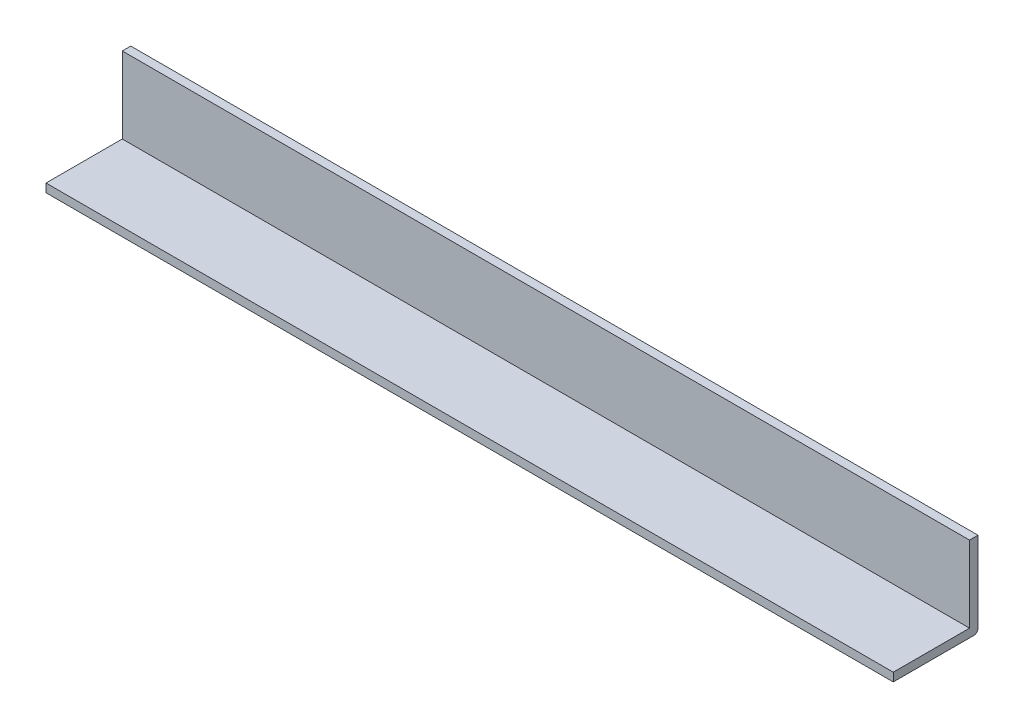
ISO-10303-21;
HEADER;
FILE_DESCRIPTION(('STEP AP214'),'2;1');
FILE_NAME('part.step','',(''),(''),'','','');
FILE_SCHEMA(('AUTOMOTIVE_DESIGN { 1 0 10303 214 1 1 1 1 }'));
ENDSEC;
DATA;
#1=APPLICATION_CONTEXT('core data for automotive mechanical design processes');
#2=APPLICATION_PROTOCOL_DEFINITION('international standard','automotive_design',2000,#1);
#3=PRODUCT_CONTEXT('',#1,'mechanical');
#4=PRODUCT('Part','Part','',(#3));
#5=PRODUCT_RELATED_PRODUCT_CATEGORY('part','',(#4));
#6=PRODUCT_DEFINITION_FORMATION('','',#4);
#7=PRODUCT_DEFINITION_CONTEXT('part definition',#1,'design');
#8=PRODUCT_DEFINITION('design','',#6,#7);
#9=PRODUCT_DEFINITION_SHAPE('','',#8);
#10=(LENGTH_UNIT() NAMED_UNIT(*) SI_UNIT(.MILLI.,.METRE.));
#11=(NAMED_UNIT(*) PLANE_ANGLE_UNIT() SI_UNIT($,.RADIAN.));
#12=(NAMED_UNIT(*) SI_UNIT($,.STERADIAN.) SOLID_ANGLE_UNIT());
#13=UNCERTAINTY_MEASURE_WITH_UNIT(LENGTH_MEASURE(1.E-05),#10,'distance_accuracy_value','');
#14=(GEOMETRIC_REPRESENTATION_CONTEXT(3) GLOBAL_UNCERTAINTY_ASSIGNED_CONTEXT((#13)) GLOBAL_UNIT_ASSIGNED_CONTEXT((#10,
#11,#12)) REPRESENTATION_CONTEXT('',''));
#15=CARTESIAN_POINT('',(0.,0.,0.));
#16=DIRECTION('',(0.,0.,1.));
#17=DIRECTION('',(1.,0.,0.));
#18=AXIS2_PLACEMENT_3D('',#15,#16,#17);
#19=CARTESIAN_POINT('',(100.,6.31112979018479,-0.871241454827603));
#20=DIRECTION('',(0.,1.,0.));
#21=DIRECTION('',(0.,0.,1.));
#22=AXIS2_PLACEMENT_3D('',#19,#20,#21);
#23=PLANE('',#22);
#24=DIRECTION('',(0.,0.,-1.));
#25=VECTOR('',#24,1.);
#26=CARTESIAN_POINT('',(0.,6.31112979018479,-0.871241454827603));
#27=LINE('',#26,#25);
#28=CARTESIAN_POINT('',(0.,6.31112979018478,19.6378948464823));
#29=VERTEX_POINT('',#28);
#30=CARTESIAN_POINT('',(0.,6.31112979018479,10.1378948464823));
#31=VERTEX_POINT('',#30);
#32=EDGE_CURVE('E121',#29,#31,#27,.T.);
#33=ORIENTED_EDGE('',*,*,#32,.T.);
#34=DIRECTION('',(-1.,0.,0.));
#35=VECTOR('',#34,1.);
#36=CARTESIAN_POINT('',(100.,6.31112979018479,10.1378948464823));
#37=LINE('',#36,#35);
#38=CARTESIAN_POINT('',(100.,6.31112979018479,10.1378948464823));
#39=VERTEX_POINT('',#38);
#40=EDGE_CURVE('E11',#39,#31,#37,.T.);
#41=ORIENTED_EDGE('',*,*,#40,.F.);
#42=DIRECTION('',(0.,0.,-1.));
#43=VECTOR('',#42,1.);
#44=CARTESIAN_POINT('',(100.,6.31112979018479,-0.871241454827603));
#45=LINE('',#44,#43);
#46=CARTESIAN_POINT('',(100.,6.31112979018478,19.6378948464823));
#47=VERTEX_POINT('',#46);
#48=EDGE_CURVE('E82',#47,#39,#45,.T.);
#49=ORIENTED_EDGE('',*,*,#48,.F.);
#50=DIRECTION('',(-1.,0.,0.));
#51=VECTOR('',#50,1.);
#52=CARTESIAN_POINT('',(100.,6.31112979018478,19.6378948464823));
#53=LINE('',#52,#51);
#54=EDGE_CURVE('E117',#47,#29,#53,.T.);
#55=ORIENTED_EDGE('',*,*,#54,.T.);
#56=EDGE_LOOP('',(#33,#41,#49,#55));
#57=FACE_BOUND('',#56,.T.);
#58=ADVANCED_FACE('F33',(#57),#23,.F.);
#59=CARTESIAN_POINT('',(100.,6.81112979018479,10.1378948464823));
#60=DIRECTION('',(-1.,0.,0.));
#61=DIRECTION('',(0.,0.,1.));
#62=AXIS2_PLACEMENT_3D('',#59,#60,#61);
#63=CYLINDRICAL_SURFACE('',#62,0.5);
#64=CARTESIAN_POINT('',(0.,6.81112979018479,10.1378948464823));
#65=DIRECTION('',(1.,0.,0.));
#66=DIRECTION('',(0.,0.,-1.));
#67=AXIS2_PLACEMENT_3D('',#64,#65,#66);
#68=CIRCLE('',#67,0.5);
#69=CARTESIAN_POINT('',(0.,6.81112979018479,9.63789484648225));
#70=VERTEX_POINT('',#69);
#71=EDGE_CURVE('E124',#70,#31,#68,.F.);
#72=ORIENTED_EDGE('',*,*,#71,.F.);
#73=DIRECTION('',(-1.,0.,0.));
#74=VECTOR('',#73,1.);
#75=CARTESIAN_POINT('',(100.,6.81112979018479,9.63789484648225));
#76=LINE('',#75,#74);
#77=CARTESIAN_POINT('',(100.,6.81112979018479,9.63789484648225));
#78=VERTEX_POINT('',#77);
#79=EDGE_CURVE('E41',#78,#70,#76,.T.);
#80=ORIENTED_EDGE('',*,*,#79,.F.);
#81=CARTESIAN_POINT('',(100.,6.81112979018479,10.1378948464823));
#82=DIRECTION('',(1.,0.,0.));
#83=DIRECTION('',(0.,0.,-1.));
#84=AXIS2_PLACEMENT_3D('',#81,#82,#83);
#85=CIRCLE('',#84,0.5);
#86=EDGE_CURVE('E156',#78,#39,#85,.F.);
#87=ORIENTED_EDGE('',*,*,#86,.T.);
#88=ORIENTED_EDGE('',*,*,#40,.T.);
#89=EDGE_LOOP('',(#72,#80,#87,#88));
#90=FACE_BOUND('',#89,.T.);
#91=ADVANCED_FACE('F149',(#90),#63,.T.);
#92=CARTESIAN_POINT('',(100.,9.09144815564303,9.63789484648225));
#93=DIRECTION('',(0.,0.,-1.));
#94=DIRECTION('',(-1.,0.,0.));
#95=AXIS2_PLACEMENT_3D('',#92,#93,#94);
#96=PLANE('',#95);
#97=DIRECTION('',(0.,-1.,0.));
#98=VECTOR('',#97,1.);
#99=CARTESIAN_POINT('',(0.,9.09144815564303,9.63789484648225));
#100=LINE('',#99,#98);
#101=CARTESIAN_POINT('',(0.,16.3111297901848,9.63789484648225));
#102=VERTEX_POINT('',#101);
#103=EDGE_CURVE('E127',#102,#70,#100,.T.);
#104=ORIENTED_EDGE('',*,*,#103,.F.);
#105=DIRECTION('',(-1.,0.,0.));
#106=VECTOR('',#105,1.);
#107=CARTESIAN_POINT('',(100.,16.3111297901848,9.63789484648225));
#108=LINE('',#107,#106);
#109=CARTESIAN_POINT('',(100.,16.3111297901848,9.63789484648225));
#110=VERTEX_POINT('',#109);
#111=EDGE_CURVE('E140',#110,#102,#108,.T.);
#112=ORIENTED_EDGE('',*,*,#111,.F.);
#113=DIRECTION('',(0.,-1.,0.));
#114=VECTOR('',#113,1.);
#115=CARTESIAN_POINT('',(100.,9.09144815564303,9.63789484648225));
#116=LINE('',#115,#114);
#117=EDGE_CURVE('E146',#110,#78,#116,.T.);
#118=ORIENTED_EDGE('',*,*,#117,.T.);
#119=ORIENTED_EDGE('',*,*,#79,.T.);
#120=EDGE_LOOP('',(#104,#112,#118,#119));
#121=FACE_BOUND('',#120,.T.);
#122=ADVANCED_FACE('F145',(#121),#96,.T.);
#123=CARTESIAN_POINT('',(100.,16.3111297901848,-0.871241454827603));
#124=DIRECTION('',(0.,-1.,0.));
#125=DIRECTION('',(0.,0.,-1.));
#126=AXIS2_PLACEMENT_3D('',#123,#124,#125);
#127=PLANE('',#126);
#128=DIRECTION('',(0.,0.,1.));
#129=VECTOR('',#128,1.);
#130=CARTESIAN_POINT('',(0.,16.3111297901848,-0.871241454827603));
#131=LINE('',#130,#129);
#132=CARTESIAN_POINT('',(0.,16.3111297901848,10.6378948464823));
#133=VERTEX_POINT('',#132);
#134=EDGE_CURVE('E130',#102,#133,#131,.T.);
#135=ORIENTED_EDGE('',*,*,#134,.T.);
#136=DIRECTION('',(-1.,0.,0.));
#137=VECTOR('',#136,1.);
#138=CARTESIAN_POINT('',(100.,16.3111297901848,10.6378948464823));
#139=LINE('',#138,#137);
#140=CARTESIAN_POINT('',(100.,16.3111297901848,10.6378948464823));
#141=VERTEX_POINT('',#140);
#142=EDGE_CURVE('E106',#141,#133,#139,.T.);
#143=ORIENTED_EDGE('',*,*,#142,.F.);
#144=DIRECTION('',(0.,0.,1.));
#145=VECTOR('',#144,1.);
#146=CARTESIAN_POINT('',(100.,16.3111297901848,-0.871241454827603));
#147=LINE('',#146,#145);
#148=EDGE_CURVE('E112',#110,#141,#147,.T.);
#149=ORIENTED_EDGE('',*,*,#148,.F.);
#150=ORIENTED_EDGE('',*,*,#111,.T.);
#151=EDGE_LOOP('',(#135,#143,#149,#150));
#152=FACE_BOUND('',#151,.T.);
#153=ADVANCED_FACE('F155',(#152),#127,.F.);
#154=CARTESIAN_POINT('',(100.,9.09144815564303,10.6378948464823));
#155=DIRECTION('',(0.,0.,1.));
#156=DIRECTION('',(1.,0.,0.));
#157=AXIS2_PLACEMENT_3D('',#154,#155,#156);
#158=PLANE('',#157);
#159=DIRECTION('',(0.,1.,0.));
#160=VECTOR('',#159,1.);
#161=CARTESIAN_POINT('',(0.,9.09144815564303,10.6378948464823));
#162=LINE('',#161,#160);
#163=CARTESIAN_POINT('',(0.,7.31112979018478,10.6378948464823));
#164=VERTEX_POINT('',#163);
#165=EDGE_CURVE('E101',#164,#133,#162,.T.);
#166=ORIENTED_EDGE('',*,*,#165,.F.);
#167=DIRECTION('',(-1.,0.,0.));
#168=VECTOR('',#167,1.);
#169=CARTESIAN_POINT('',(100.,7.31112979018478,10.6378948464823));
#170=LINE('',#169,#168);
#171=CARTESIAN_POINT('',(100.,7.31112979018478,10.6378948464823));
#172=VERTEX_POINT('',#171);
#173=EDGE_CURVE('E96',#172,#164,#170,.T.);
#174=ORIENTED_EDGE('',*,*,#173,.F.);
#175=DIRECTION('',(0.,1.,0.));
#176=VECTOR('',#175,1.);
#177=CARTESIAN_POINT('',(100.,9.09144815564303,10.6378948464823));
#178=LINE('',#177,#176);
#179=EDGE_CURVE('E99',#172,#141,#178,.T.);
#180=ORIENTED_EDGE('',*,*,#179,.T.);
#181=ORIENTED_EDGE('',*,*,#142,.T.);
#182=EDGE_LOOP('',(#166,#174,#180,#181));
#183=FACE_BOUND('',#182,.T.);
#184=ADVANCED_FACE('F98',(#183),#158,.T.);
#185=CARTESIAN_POINT('',(100.,7.31112979018478,-0.871241454827603));
#186=DIRECTION('',(0.,1.,0.));
#187=DIRECTION('',(0.,0.,1.));
#188=AXIS2_PLACEMENT_3D('',#185,#186,#187);
#189=PLANE('',#188);
#190=DIRECTION('',(0.,0.,-1.));
#191=VECTOR('',#190,1.);
#192=CARTESIAN_POINT('',(0.,7.31112979018478,-0.871241454827603));
#193=LINE('',#192,#191);
#194=CARTESIAN_POINT('',(0.,7.31112979018479,19.6378948464823));
#195=VERTEX_POINT('',#194);
#196=EDGE_CURVE('E134',#195,#164,#193,.T.);
#197=ORIENTED_EDGE('',*,*,#196,.F.);
#198=DIRECTION('',(-1.,0.,0.));
#199=VECTOR('',#198,1.);
#200=CARTESIAN_POINT('',(100.,7.31112979018479,19.6378948464823));
#201=LINE('',#200,#199);
#202=CARTESIAN_POINT('',(100.,7.31112979018479,19.6378948464823));
#203=VERTEX_POINT('',#202);
#204=EDGE_CURVE('E73',#203,#195,#201,.T.);
#205=ORIENTED_EDGE('',*,*,#204,.F.);
#206=DIRECTION('',(0.,0.,-1.));
#207=VECTOR('',#206,1.);
#208=CARTESIAN_POINT('',(100.,7.31112979018478,-0.871241454827603));
#209=LINE('',#208,#207);
#210=EDGE_CURVE('E109',#203,#172,#209,.T.);
#211=ORIENTED_EDGE('',*,*,#210,.T.);
#212=ORIENTED_EDGE('',*,*,#173,.T.);
#213=EDGE_LOOP('',(#197,#205,#211,#212));
#214=FACE_BOUND('',#213,.T.);
#215=ADVANCED_FACE('F115',(#214),#189,.T.);
#216=CARTESIAN_POINT('',(100.,9.09144815564303,19.6378948464823));
#217=DIRECTION('',(0.,0.,-1.));
#218=DIRECTION('',(-1.,0.,0.));
#219=AXIS2_PLACEMENT_3D('',#216,#217,#218);
#220=PLANE('',#219);
#221=DIRECTION('',(0.,-1.,0.));
#222=VECTOR('',#221,1.);
#223=CARTESIAN_POINT('',(0.,9.09144815564303,19.6378948464823));
#224=LINE('',#223,#222);
#225=EDGE_CURVE('E76',#195,#29,#224,.T.);
#226=ORIENTED_EDGE('',*,*,#225,.T.);
#227=ORIENTED_EDGE('',*,*,#54,.F.);
#228=DIRECTION('',(0.,-1.,0.));
#229=VECTOR('',#228,1.);
#230=CARTESIAN_POINT('',(100.,9.09144815564303,19.6378948464823));
#231=LINE('',#230,#229);
#232=EDGE_CURVE('E49',#203,#47,#231,.T.);
#233=ORIENTED_EDGE('',*,*,#232,.F.);
#234=ORIENTED_EDGE('',*,*,#204,.T.);
#235=EDGE_LOOP('',(#226,#227,#233,#234));
#236=FACE_BOUND('',#235,.T.);
#237=ADVANCED_FACE('F173',(#236),#220,.F.);
#238=CARTESIAN_POINT('',(100.,9.09144815564303,-0.871241454827603));
#239=DIRECTION('',(1.,0.,0.));
#240=DIRECTION('',(0.,0.,-1.));
#241=AXIS2_PLACEMENT_3D('',#238,#239,#240);
#242=PLANE('',#241);
#243=ORIENTED_EDGE('',*,*,#48,.T.);
#244=ORIENTED_EDGE('',*,*,#86,.F.);
#245=ORIENTED_EDGE('',*,*,#117,.F.);
#246=ORIENTED_EDGE('',*,*,#148,.T.);
#247=ORIENTED_EDGE('',*,*,#179,.F.);
#248=ORIENTED_EDGE('',*,*,#210,.F.);
#249=ORIENTED_EDGE('',*,*,#232,.T.);
#250=EDGE_LOOP('',(#243,#244,#245,#246,#247,#248,#249));
#251=FACE_BOUND('',#250,.T.);
#252=ADVANCED_FACE('F108',(#251),#242,.T.);
#253=CARTESIAN_POINT('',(0.,9.09144815564303,-0.871241454827603));
#254=DIRECTION('',(1.,0.,0.));
#255=DIRECTION('',(0.,0.,-1.));
#256=AXIS2_PLACEMENT_3D('',#253,#254,#255);
#257=PLANE('',#256);
#258=ORIENTED_EDGE('',*,*,#32,.F.);
#259=ORIENTED_EDGE('',*,*,#225,.F.);
#260=ORIENTED_EDGE('',*,*,#196,.T.);
#261=ORIENTED_EDGE('',*,*,#165,.T.);
#262=ORIENTED_EDGE('',*,*,#134,.F.);
#263=ORIENTED_EDGE('',*,*,#103,.T.);
#264=ORIENTED_EDGE('',*,*,#71,.T.);
#265=EDGE_LOOP('',(#258,#259,#260,#261,#262,#263,#264));
#266=FACE_BOUND('',#265,.T.);
#267=ADVANCED_FACE('F153',(#266),#257,.F.);
#268=CLOSED_SHELL('',(#58,#91,#122,#153,#184,#215,#237,#252,#267));
#269=MANIFOLD_SOLID_BREP('B2',#268);
#270=ADVANCED_BREP_SHAPE_REPRESENTATION('',(#18,#269),#14);
#271=SHAPE_DEFINITION_REPRESENTATION(#9,#270);
ENDSEC;
END-ISO-10303-21;
